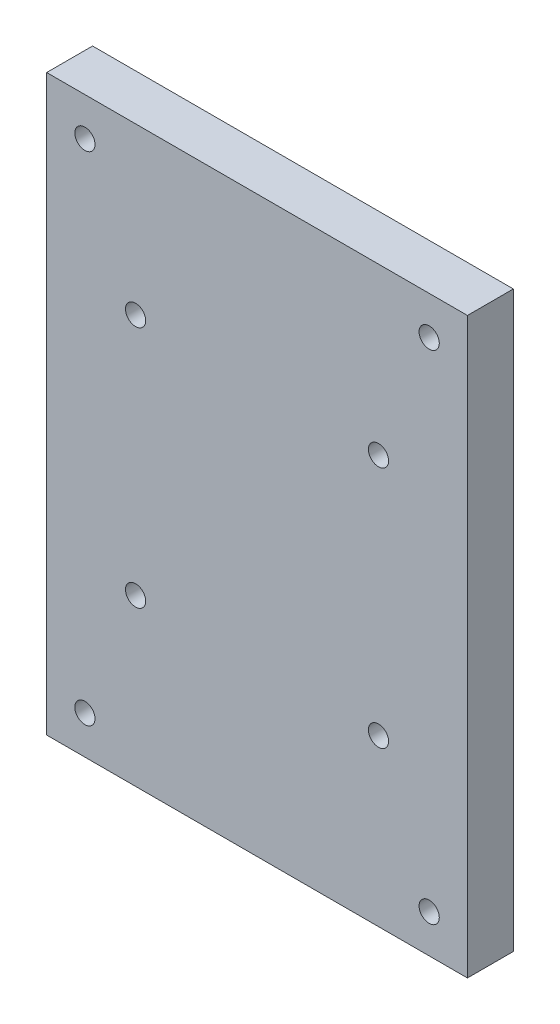
ISO-10303-21;
HEADER;
FILE_DESCRIPTION(('STEP AP214'),'2;1');
FILE_NAME('part.step','',(''),(''),'','','');
FILE_SCHEMA(('AUTOMOTIVE_DESIGN { 1 0 10303 214 1 1 1 1 }'));
ENDSEC;
DATA;
#1=APPLICATION_CONTEXT('core data for automotive mechanical design processes');
#2=APPLICATION_PROTOCOL_DEFINITION('international standard','automotive_design',2000,#1);
#3=PRODUCT_CONTEXT('',#1,'mechanical');
#4=PRODUCT('Part','Part','',(#3));
#5=PRODUCT_RELATED_PRODUCT_CATEGORY('part','',(#4));
#6=PRODUCT_DEFINITION_FORMATION('','',#4);
#7=PRODUCT_DEFINITION_CONTEXT('part definition',#1,'design');
#8=PRODUCT_DEFINITION('design','',#6,#7);
#9=PRODUCT_DEFINITION_SHAPE('','',#8);
#10=(LENGTH_UNIT() NAMED_UNIT(*) SI_UNIT(.MILLI.,.METRE.));
#11=(NAMED_UNIT(*) PLANE_ANGLE_UNIT() SI_UNIT($,.RADIAN.));
#12=(NAMED_UNIT(*) SI_UNIT($,.STERADIAN.) SOLID_ANGLE_UNIT());
#13=UNCERTAINTY_MEASURE_WITH_UNIT(LENGTH_MEASURE(1.E-05),#10,'distance_accuracy_value','');
#14=(GEOMETRIC_REPRESENTATION_CONTEXT(3) GLOBAL_UNCERTAINTY_ASSIGNED_CONTEXT((#13)) GLOBAL_UNIT_ASSIGNED_CONTEXT((#10,
#11,#12)) REPRESENTATION_CONTEXT('',''));
#15=CARTESIAN_POINT('',(0.,0.,0.));
#16=DIRECTION('',(0.,0.,1.));
#17=DIRECTION('',(1.,0.,0.));
#18=AXIS2_PLACEMENT_3D('',#15,#16,#17);
#19=CARTESIAN_POINT('',(-11.6249999999999,-53.3750000000001,6.));
#20=DIRECTION('',(0.,0.,-1.));
#21=DIRECTION('',(-1.,0.,0.));
#22=AXIS2_PLACEMENT_3D('',#19,#20,#21);
#23=CYLINDRICAL_SURFACE('',#22,1.32);
#24=CARTESIAN_POINT('',(-11.6249999999999,-53.3750000000001,6.));
#25=DIRECTION('',(0.,0.,1.));
#26=DIRECTION('',(1.,0.,0.));
#27=AXIS2_PLACEMENT_3D('',#24,#25,#26);
#28=CIRCLE('',#27,1.32);
#29=CARTESIAN_POINT('',(-10.3049999999999,-53.3750000000001,6.));
#30=VERTEX_POINT('',#29);
#31=EDGE_CURVE('E166',#30,#30,#28,.T.);
#32=ORIENTED_EDGE('',*,*,#31,.T.);
#33=EDGE_LOOP('',(#32));
#34=FACE_BOUND('',#33,.T.);
#35=CARTESIAN_POINT('',(-11.6249999999999,-53.3750000000001,4.));
#36=DIRECTION('',(0.,0.,-1.));
#37=DIRECTION('',(-1.,0.,0.));
#38=AXIS2_PLACEMENT_3D('',#35,#36,#37);
#39=CIRCLE('',#38,1.32);
#40=CARTESIAN_POINT('',(-12.9449999999999,-53.3750000000001,4.));
#41=VERTEX_POINT('',#40);
#42=EDGE_CURVE('E39',#41,#41,#39,.T.);
#43=ORIENTED_EDGE('',*,*,#42,.T.);
#44=EDGE_LOOP('',(#43));
#45=FACE_BOUND('',#44,.T.);
#46=ADVANCED_FACE('F35',(#34,#45),#23,.F.);
#47=CARTESIAN_POINT('',(-43.3750000000002,-53.3750000000001,6.));
#48=DIRECTION('',(0.,0.,-1.));
#49=DIRECTION('',(-1.,0.,0.));
#50=AXIS2_PLACEMENT_3D('',#47,#48,#49);
#51=CYLINDRICAL_SURFACE('',#50,1.32);
#52=CARTESIAN_POINT('',(-43.3750000000002,-53.3750000000001,6.));
#53=DIRECTION('',(0.,0.,1.));
#54=DIRECTION('',(1.,0.,0.));
#55=AXIS2_PLACEMENT_3D('',#52,#53,#54);
#56=CIRCLE('',#55,1.32);
#57=CARTESIAN_POINT('',(-42.0550000000002,-53.3750000000001,6.));
#58=VERTEX_POINT('',#57);
#59=EDGE_CURVE('E161',#58,#58,#56,.T.);
#60=ORIENTED_EDGE('',*,*,#59,.T.);
#61=EDGE_LOOP('',(#60));
#62=FACE_BOUND('',#61,.T.);
#63=CARTESIAN_POINT('',(-43.3750000000002,-53.3750000000001,4.));
#64=DIRECTION('',(0.,0.,-1.));
#65=DIRECTION('',(-1.,0.,0.));
#66=AXIS2_PLACEMENT_3D('',#63,#64,#65);
#67=CIRCLE('',#66,1.32);
#68=CARTESIAN_POINT('',(-44.6950000000002,-53.3750000000001,4.));
#69=VERTEX_POINT('',#68);
#70=EDGE_CURVE('E121',#69,#69,#67,.T.);
#71=ORIENTED_EDGE('',*,*,#70,.T.);
#72=EDGE_LOOP('',(#71));
#73=FACE_BOUND('',#72,.T.);
#74=ADVANCED_FACE('F201',(#62,#73),#51,.F.);
#75=CARTESIAN_POINT('',(-43.3750000000002,-21.6250000000001,6.));
#76=DIRECTION('',(0.,0.,-1.));
#77=DIRECTION('',(-1.,0.,0.));
#78=AXIS2_PLACEMENT_3D('',#75,#76,#77);
#79=CYLINDRICAL_SURFACE('',#78,1.32);
#80=CARTESIAN_POINT('',(-43.3750000000002,-21.6250000000001,6.));
#81=DIRECTION('',(0.,0.,1.));
#82=DIRECTION('',(1.,0.,0.));
#83=AXIS2_PLACEMENT_3D('',#80,#81,#82);
#84=CIRCLE('',#83,1.32);
#85=CARTESIAN_POINT('',(-42.0550000000002,-21.6250000000001,6.));
#86=VERTEX_POINT('',#85);
#87=EDGE_CURVE('E106',#86,#86,#84,.T.);
#88=ORIENTED_EDGE('',*,*,#87,.T.);
#89=EDGE_LOOP('',(#88));
#90=FACE_BOUND('',#89,.T.);
#91=CARTESIAN_POINT('',(-43.3750000000002,-21.6250000000001,4.));
#92=DIRECTION('',(0.,0.,-1.));
#93=DIRECTION('',(-1.,0.,0.));
#94=AXIS2_PLACEMENT_3D('',#91,#92,#93);
#95=CIRCLE('',#94,1.32);
#96=CARTESIAN_POINT('',(-44.6950000000002,-21.6250000000001,4.));
#97=VERTEX_POINT('',#96);
#98=EDGE_CURVE('E117',#97,#97,#95,.T.);
#99=ORIENTED_EDGE('',*,*,#98,.T.);
#100=EDGE_LOOP('',(#99));
#101=FACE_BOUND('',#100,.T.);
#102=ADVANCED_FACE('F181',(#90,#101),#79,.F.);
#103=CARTESIAN_POINT('',(-11.6250000000002,-21.6250000000001,6.));
#104=DIRECTION('',(0.,0.,-1.));
#105=DIRECTION('',(-1.,0.,0.));
#106=AXIS2_PLACEMENT_3D('',#103,#104,#105);
#107=CYLINDRICAL_SURFACE('',#106,1.32);
#108=CARTESIAN_POINT('',(-11.6250000000002,-21.6250000000001,6.));
#109=DIRECTION('',(0.,0.,1.));
#110=DIRECTION('',(1.,0.,0.));
#111=AXIS2_PLACEMENT_3D('',#108,#109,#110);
#112=CIRCLE('',#111,1.32);
#113=CARTESIAN_POINT('',(-10.3050000000002,-21.6250000000001,6.));
#114=VERTEX_POINT('',#113);
#115=EDGE_CURVE('E169',#114,#114,#112,.T.);
#116=ORIENTED_EDGE('',*,*,#115,.T.);
#117=EDGE_LOOP('',(#116));
#118=FACE_BOUND('',#117,.T.);
#119=CARTESIAN_POINT('',(-11.6250000000002,-21.6250000000001,4.));
#120=DIRECTION('',(0.,0.,-1.));
#121=DIRECTION('',(-1.,0.,0.));
#122=AXIS2_PLACEMENT_3D('',#119,#120,#121);
#123=CIRCLE('',#122,1.32);
#124=CARTESIAN_POINT('',(-12.9450000000002,-21.6250000000001,4.));
#125=VERTEX_POINT('',#124);
#126=EDGE_CURVE('E112',#125,#125,#123,.T.);
#127=ORIENTED_EDGE('',*,*,#126,.T.);
#128=EDGE_LOOP('',(#127));
#129=FACE_BOUND('',#128,.T.);
#130=ADVANCED_FACE('F186',(#118,#129),#107,.F.);
#131=CARTESIAN_POINT('',(0.,0.,6.));
#132=DIRECTION('',(0.,0.,-1.));
#133=DIRECTION('',(-1.,0.,0.));
#134=AXIS2_PLACEMENT_3D('',#131,#132,#133);
#135=PLANE('',#134);
#136=CARTESIAN_POINT('',(-4.99999999999932,-70.,6.));
#137=DIRECTION('',(0.,0.,1.));
#138=DIRECTION('',(1.,0.,0.));
#139=AXIS2_PLACEMENT_3D('',#136,#137,#138);
#140=CIRCLE('',#139,1.32);
#141=CARTESIAN_POINT('',(-3.67999999999932,-70.,6.));
#142=VERTEX_POINT('',#141);
#143=EDGE_CURVE('E152',#142,#142,#140,.T.);
#144=ORIENTED_EDGE('',*,*,#143,.F.);
#145=EDGE_LOOP('',(#144));
#146=FACE_BOUND('',#145,.T.);
#147=ORIENTED_EDGE('',*,*,#59,.F.);
#148=EDGE_LOOP('',(#147));
#149=FACE_BOUND('',#148,.T.);
#150=ORIENTED_EDGE('',*,*,#115,.F.);
#151=EDGE_LOOP('',(#150));
#152=FACE_BOUND('',#151,.T.);
#153=ORIENTED_EDGE('',*,*,#87,.F.);
#154=EDGE_LOOP('',(#153));
#155=FACE_BOUND('',#154,.T.);
#156=DIRECTION('',(0.,1.,0.));
#157=VECTOR('',#156,1.);
#158=CARTESIAN_POINT('',(0.,0.,6.));
#159=LINE('',#158,#157);
#160=CARTESIAN_POINT('',(0.,-75.,6.));
#161=VERTEX_POINT('',#160);
#162=CARTESIAN_POINT('',(0.,0.,6.));
#163=VERTEX_POINT('',#162);
#164=EDGE_CURVE('E90',#161,#163,#159,.T.);
#165=ORIENTED_EDGE('',*,*,#164,.T.);
#166=DIRECTION('',(-1.,0.,0.));
#167=VECTOR('',#166,1.);
#168=CARTESIAN_POINT('',(0.,0.,6.));
#169=LINE('',#168,#167);
#170=CARTESIAN_POINT('',(-55.,0.,6.));
#171=VERTEX_POINT('',#170);
#172=EDGE_CURVE('E84',#163,#171,#169,.T.);
#173=ORIENTED_EDGE('',*,*,#172,.T.);
#174=DIRECTION('',(0.,-1.,0.));
#175=VECTOR('',#174,1.);
#176=CARTESIAN_POINT('',(-55.,0.,6.));
#177=LINE('',#176,#175);
#178=CARTESIAN_POINT('',(-55.,-75.,6.));
#179=VERTEX_POINT('',#178);
#180=EDGE_CURVE('E88',#171,#179,#177,.T.);
#181=ORIENTED_EDGE('',*,*,#180,.T.);
#182=DIRECTION('',(1.,0.,0.));
#183=VECTOR('',#182,1.);
#184=CARTESIAN_POINT('',(0.,-75.,6.));
#185=LINE('',#184,#183);
#186=EDGE_CURVE('E54',#179,#161,#185,.T.);
#187=ORIENTED_EDGE('',*,*,#186,.T.);
#188=EDGE_LOOP('',(#165,#173,#181,#187));
#189=FACE_BOUND('',#188,.T.);
#190=CARTESIAN_POINT('',(-50.,-5.,6.));
#191=DIRECTION('',(0.,0.,1.));
#192=DIRECTION('',(1.,0.,0.));
#193=AXIS2_PLACEMENT_3D('',#190,#191,#192);
#194=CIRCLE('',#193,1.32);
#195=CARTESIAN_POINT('',(-48.68,-5.,6.));
#196=VERTEX_POINT('',#195);
#197=EDGE_CURVE('E173',#196,#196,#194,.T.);
#198=ORIENTED_EDGE('',*,*,#197,.F.);
#199=EDGE_LOOP('',(#198));
#200=FACE_BOUND('',#199,.T.);
#201=ORIENTED_EDGE('',*,*,#31,.F.);
#202=EDGE_LOOP('',(#201));
#203=FACE_BOUND('',#202,.T.);
#204=CARTESIAN_POINT('',(-5.,-5.,6.));
#205=DIRECTION('',(0.,0.,1.));
#206=DIRECTION('',(1.,0.,0.));
#207=AXIS2_PLACEMENT_3D('',#204,#205,#206);
#208=CIRCLE('',#207,1.32);
#209=CARTESIAN_POINT('',(-3.68,-5.,6.));
#210=VERTEX_POINT('',#209);
#211=EDGE_CURVE('E158',#210,#210,#208,.T.);
#212=ORIENTED_EDGE('',*,*,#211,.F.);
#213=EDGE_LOOP('',(#212));
#214=FACE_BOUND('',#213,.T.);
#215=CARTESIAN_POINT('',(-49.9999999999993,-70.,6.));
#216=DIRECTION('',(0.,0.,1.));
#217=DIRECTION('',(1.,0.,0.));
#218=AXIS2_PLACEMENT_3D('',#215,#216,#217);
#219=CIRCLE('',#218,1.32);
#220=CARTESIAN_POINT('',(-48.6799999999993,-70.,6.));
#221=VERTEX_POINT('',#220);
#222=EDGE_CURVE('E146',#221,#221,#219,.T.);
#223=ORIENTED_EDGE('',*,*,#222,.F.);
#224=EDGE_LOOP('',(#223));
#225=FACE_BOUND('',#224,.T.);
#226=ADVANCED_FACE('F85',(#146,#149,#152,#155,#189,#200,#203,#214,#225),#135,.F.);
#227=CARTESIAN_POINT('',(0.,0.,0.));
#228=DIRECTION('',(0.,0.,-1.));
#229=DIRECTION('',(-1.,0.,0.));
#230=AXIS2_PLACEMENT_3D('',#227,#228,#229);
#231=PLANE('',#230);
#232=CARTESIAN_POINT('',(-11.6250000000006,-53.3750000000001,0.));
#233=DIRECTION('',(0.,0.,-1.));
#234=DIRECTION('',(-1.,0.,0.));
#235=AXIS2_PLACEMENT_3D('',#232,#233,#234);
#236=CIRCLE('',#235,3.25);
#237=CARTESIAN_POINT('',(-14.8750000000006,-53.3750000000001,0.));
#238=VERTEX_POINT('',#237);
#239=EDGE_CURVE('E137',#238,#238,#236,.T.);
#240=ORIENTED_EDGE('',*,*,#239,.F.);
#241=EDGE_LOOP('',(#240));
#242=FACE_BOUND('',#241,.T.);
#243=CARTESIAN_POINT('',(-43.3750000000006,-53.3750000000001,0.));
#244=DIRECTION('',(0.,0.,-1.));
#245=DIRECTION('',(-1.,0.,0.));
#246=AXIS2_PLACEMENT_3D('',#243,#244,#245);
#247=CIRCLE('',#246,3.25000000000001);
#248=CARTESIAN_POINT('',(-46.6250000000006,-53.3750000000001,0.));
#249=VERTEX_POINT('',#248);
#250=EDGE_CURVE('E130',#249,#249,#247,.T.);
#251=ORIENTED_EDGE('',*,*,#250,.F.);
#252=EDGE_LOOP('',(#251));
#253=FACE_BOUND('',#252,.T.);
#254=CARTESIAN_POINT('',(-43.3750000000002,-21.6250000000001,0.));
#255=DIRECTION('',(0.,0.,-1.));
#256=DIRECTION('',(-1.,0.,0.));
#257=AXIS2_PLACEMENT_3D('',#254,#255,#256);
#258=CIRCLE('',#257,3.25000000000001);
#259=CARTESIAN_POINT('',(-46.6250000000002,-21.6250000000001,0.));
#260=VERTEX_POINT('',#259);
#261=EDGE_CURVE('E123',#260,#260,#258,.T.);
#262=ORIENTED_EDGE('',*,*,#261,.F.);
#263=EDGE_LOOP('',(#262));
#264=FACE_BOUND('',#263,.T.);
#265=CARTESIAN_POINT('',(-11.6250000000002,-21.6250000000001,0.));
#266=DIRECTION('',(0.,0.,-1.));
#267=DIRECTION('',(-1.,0.,0.));
#268=AXIS2_PLACEMENT_3D('',#265,#266,#267);
#269=CIRCLE('',#268,3.25);
#270=CARTESIAN_POINT('',(-14.8750000000002,-21.6250000000001,0.));
#271=VERTEX_POINT('',#270);
#272=EDGE_CURVE('E119',#271,#271,#269,.T.);
#273=ORIENTED_EDGE('',*,*,#272,.F.);
#274=EDGE_LOOP('',(#273));
#275=FACE_BOUND('',#274,.T.);
#276=CARTESIAN_POINT('',(-4.99999999999932,-70.,0.));
#277=DIRECTION('',(0.,0.,1.));
#278=DIRECTION('',(1.,0.,0.));
#279=AXIS2_PLACEMENT_3D('',#276,#277,#278);
#280=CIRCLE('',#279,1.32);
#281=CARTESIAN_POINT('',(-3.67999999999932,-70.,0.));
#282=VERTEX_POINT('',#281);
#283=EDGE_CURVE('E149',#282,#282,#280,.T.);
#284=ORIENTED_EDGE('',*,*,#283,.T.);
#285=EDGE_LOOP('',(#284));
#286=FACE_BOUND('',#285,.T.);
#287=DIRECTION('',(0.,1.,0.));
#288=VECTOR('',#287,1.);
#289=CARTESIAN_POINT('',(0.,0.,0.));
#290=LINE('',#289,#288);
#291=CARTESIAN_POINT('',(0.,-75.,0.));
#292=VERTEX_POINT('',#291);
#293=CARTESIAN_POINT('',(0.,0.,0.));
#294=VERTEX_POINT('',#293);
#295=EDGE_CURVE('E103',#292,#294,#290,.T.);
#296=ORIENTED_EDGE('',*,*,#295,.F.);
#297=DIRECTION('',(1.,0.,0.));
#298=VECTOR('',#297,1.);
#299=CARTESIAN_POINT('',(0.,-75.,0.));
#300=LINE('',#299,#298);
#301=CARTESIAN_POINT('',(-55.,-75.,0.));
#302=VERTEX_POINT('',#301);
#303=EDGE_CURVE('E77',#302,#292,#300,.T.);
#304=ORIENTED_EDGE('',*,*,#303,.F.);
#305=DIRECTION('',(0.,-1.,0.));
#306=VECTOR('',#305,1.);
#307=CARTESIAN_POINT('',(-55.,0.,0.));
#308=LINE('',#307,#306);
#309=CARTESIAN_POINT('',(-55.,0.,0.));
#310=VERTEX_POINT('',#309);
#311=EDGE_CURVE('E71',#310,#302,#308,.T.);
#312=ORIENTED_EDGE('',*,*,#311,.F.);
#313=DIRECTION('',(-1.,0.,0.));
#314=VECTOR('',#313,1.);
#315=CARTESIAN_POINT('',(0.,0.,0.));
#316=LINE('',#315,#314);
#317=EDGE_CURVE('E94',#294,#310,#316,.T.);
#318=ORIENTED_EDGE('',*,*,#317,.F.);
#319=EDGE_LOOP('',(#296,#304,#312,#318));
#320=FACE_BOUND('',#319,.T.);
#321=CARTESIAN_POINT('',(-50.,-5.,0.));
#322=DIRECTION('',(0.,0.,1.));
#323=DIRECTION('',(1.,0.,0.));
#324=AXIS2_PLACEMENT_3D('',#321,#322,#323);
#325=CIRCLE('',#324,1.32);
#326=CARTESIAN_POINT('',(-48.68,-5.,0.));
#327=VERTEX_POINT('',#326);
#328=EDGE_CURVE('E172',#327,#327,#325,.T.);
#329=ORIENTED_EDGE('',*,*,#328,.T.);
#330=EDGE_LOOP('',(#329));
#331=FACE_BOUND('',#330,.T.);
#332=CARTESIAN_POINT('',(-5.,-5.,0.));
#333=DIRECTION('',(0.,0.,1.));
#334=DIRECTION('',(1.,0.,0.));
#335=AXIS2_PLACEMENT_3D('',#332,#333,#334);
#336=CIRCLE('',#335,1.32);
#337=CARTESIAN_POINT('',(-3.68,-5.,0.));
#338=VERTEX_POINT('',#337);
#339=EDGE_CURVE('E155',#338,#338,#336,.T.);
#340=ORIENTED_EDGE('',*,*,#339,.T.);
#341=EDGE_LOOP('',(#340));
#342=FACE_BOUND('',#341,.T.);
#343=CARTESIAN_POINT('',(-49.9999999999993,-70.,0.));
#344=DIRECTION('',(0.,0.,1.));
#345=DIRECTION('',(1.,0.,0.));
#346=AXIS2_PLACEMENT_3D('',#343,#344,#345);
#347=CIRCLE('',#346,1.32);
#348=CARTESIAN_POINT('',(-48.6799999999993,-70.,0.));
#349=VERTEX_POINT('',#348);
#350=EDGE_CURVE('E115',#349,#349,#347,.T.);
#351=ORIENTED_EDGE('',*,*,#350,.T.);
#352=EDGE_LOOP('',(#351));
#353=FACE_BOUND('',#352,.T.);
#354=ADVANCED_FACE('F185',(#242,#253,#264,#275,#286,#320,#331,#342,#353),#231,.T.);
#355=CARTESIAN_POINT('',(0.,0.,6.));
#356=DIRECTION('',(-1.,0.,0.));
#357=DIRECTION('',(0.,-1.,0.));
#358=AXIS2_PLACEMENT_3D('',#355,#356,#357);
#359=PLANE('',#358);
#360=ORIENTED_EDGE('',*,*,#295,.T.);
#361=DIRECTION('',(0.,0.,-1.));
#362=VECTOR('',#361,1.);
#363=CARTESIAN_POINT('',(0.,0.,6.));
#364=LINE('',#363,#362);
#365=EDGE_CURVE('E11',#163,#294,#364,.T.);
#366=ORIENTED_EDGE('',*,*,#365,.F.);
#367=ORIENTED_EDGE('',*,*,#164,.F.);
#368=DIRECTION('',(0.,0.,-1.));
#369=VECTOR('',#368,1.);
#370=CARTESIAN_POINT('',(0.,-75.,6.));
#371=LINE('',#370,#369);
#372=EDGE_CURVE('E99',#161,#292,#371,.T.);
#373=ORIENTED_EDGE('',*,*,#372,.T.);
#374=EDGE_LOOP('',(#360,#366,#367,#373));
#375=FACE_BOUND('',#374,.T.);
#376=ADVANCED_FACE('F37',(#375),#359,.F.);
#377=CARTESIAN_POINT('',(0.,0.,6.));
#378=DIRECTION('',(0.,-1.,0.));
#379=DIRECTION('',(1.,0.,0.));
#380=AXIS2_PLACEMENT_3D('',#377,#378,#379);
#381=PLANE('',#380);
#382=ORIENTED_EDGE('',*,*,#317,.T.);
#383=DIRECTION('',(0.,0.,-1.));
#384=VECTOR('',#383,1.);
#385=CARTESIAN_POINT('',(-55.,0.,6.));
#386=LINE('',#385,#384);
#387=EDGE_CURVE('E45',#171,#310,#386,.T.);
#388=ORIENTED_EDGE('',*,*,#387,.F.);
#389=ORIENTED_EDGE('',*,*,#172,.F.);
#390=ORIENTED_EDGE('',*,*,#365,.T.);
#391=EDGE_LOOP('',(#382,#388,#389,#390));
#392=FACE_BOUND('',#391,.T.);
#393=ADVANCED_FACE('F93',(#392),#381,.F.);
#394=CARTESIAN_POINT('',(-55.,0.,6.));
#395=DIRECTION('',(1.,0.,0.));
#396=DIRECTION('',(0.,1.,0.));
#397=AXIS2_PLACEMENT_3D('',#394,#395,#396);
#398=PLANE('',#397);
#399=ORIENTED_EDGE('',*,*,#311,.T.);
#400=DIRECTION('',(0.,0.,-1.));
#401=VECTOR('',#400,1.);
#402=CARTESIAN_POINT('',(-55.,-75.,6.));
#403=LINE('',#402,#401);
#404=EDGE_CURVE('E95',#179,#302,#403,.T.);
#405=ORIENTED_EDGE('',*,*,#404,.F.);
#406=ORIENTED_EDGE('',*,*,#180,.F.);
#407=ORIENTED_EDGE('',*,*,#387,.T.);
#408=EDGE_LOOP('',(#399,#405,#406,#407));
#409=FACE_BOUND('',#408,.T.);
#410=ADVANCED_FACE('F97',(#409),#398,.F.);
#411=CARTESIAN_POINT('',(0.,-75.,6.));
#412=DIRECTION('',(0.,1.,0.));
#413=DIRECTION('',(-1.,0.,0.));
#414=AXIS2_PLACEMENT_3D('',#411,#412,#413);
#415=PLANE('',#414);
#416=ORIENTED_EDGE('',*,*,#303,.T.);
#417=ORIENTED_EDGE('',*,*,#372,.F.);
#418=ORIENTED_EDGE('',*,*,#186,.F.);
#419=ORIENTED_EDGE('',*,*,#404,.T.);
#420=EDGE_LOOP('',(#416,#417,#418,#419));
#421=FACE_BOUND('',#420,.T.);
#422=ADVANCED_FACE('F215',(#421),#415,.F.);
#423=CARTESIAN_POINT('',(-50.,-5.,6.));
#424=DIRECTION('',(0.,0.,-1.));
#425=DIRECTION('',(-1.,0.,0.));
#426=AXIS2_PLACEMENT_3D('',#423,#424,#425);
#427=CYLINDRICAL_SURFACE('',#426,1.32);
#428=ORIENTED_EDGE('',*,*,#197,.T.);
#429=EDGE_LOOP('',(#428));
#430=FACE_BOUND('',#429,.T.);
#431=ORIENTED_EDGE('',*,*,#328,.F.);
#432=EDGE_LOOP('',(#431));
#433=FACE_BOUND('',#432,.T.);
#434=ADVANCED_FACE('F212',(#430,#433),#427,.F.);
#435=CARTESIAN_POINT('',(-5.,-5.,6.));
#436=DIRECTION('',(0.,0.,-1.));
#437=DIRECTION('',(-1.,0.,0.));
#438=AXIS2_PLACEMENT_3D('',#435,#436,#437);
#439=CYLINDRICAL_SURFACE('',#438,1.32);
#440=ORIENTED_EDGE('',*,*,#211,.T.);
#441=EDGE_LOOP('',(#440));
#442=FACE_BOUND('',#441,.T.);
#443=ORIENTED_EDGE('',*,*,#339,.F.);
#444=EDGE_LOOP('',(#443));
#445=FACE_BOUND('',#444,.T.);
#446=ADVANCED_FACE('F214',(#442,#445),#439,.F.);
#447=CARTESIAN_POINT('',(-4.99999999999932,-70.,6.));
#448=DIRECTION('',(0.,0.,-1.));
#449=DIRECTION('',(-1.,0.,0.));
#450=AXIS2_PLACEMENT_3D('',#447,#448,#449);
#451=CYLINDRICAL_SURFACE('',#450,1.32);
#452=ORIENTED_EDGE('',*,*,#143,.T.);
#453=EDGE_LOOP('',(#452));
#454=FACE_BOUND('',#453,.T.);
#455=ORIENTED_EDGE('',*,*,#283,.F.);
#456=EDGE_LOOP('',(#455));
#457=FACE_BOUND('',#456,.T.);
#458=ADVANCED_FACE('F327',(#454,#457),#451,.F.);
#459=CARTESIAN_POINT('',(-49.9999999999993,-70.,6.));
#460=DIRECTION('',(0.,0.,-1.));
#461=DIRECTION('',(-1.,0.,0.));
#462=AXIS2_PLACEMENT_3D('',#459,#460,#461);
#463=CYLINDRICAL_SURFACE('',#462,1.32);
#464=ORIENTED_EDGE('',*,*,#222,.T.);
#465=EDGE_LOOP('',(#464));
#466=FACE_BOUND('',#465,.T.);
#467=ORIENTED_EDGE('',*,*,#350,.F.);
#468=EDGE_LOOP('',(#467));
#469=FACE_BOUND('',#468,.T.);
#470=ADVANCED_FACE('F247',(#466,#469),#463,.F.);
#471=CARTESIAN_POINT('',(-11.6250000000002,-21.6250000000001,4.));
#472=DIRECTION('',(0.,0.,-1.));
#473=DIRECTION('',(-1.,0.,0.));
#474=AXIS2_PLACEMENT_3D('',#471,#472,#473);
#475=CYLINDRICAL_SURFACE('',#474,3.25);
#476=CARTESIAN_POINT('',(-11.6250000000002,-21.6250000000001,4.));
#477=DIRECTION('',(0.,0.,-1.));
#478=DIRECTION('',(-1.,0.,0.));
#479=AXIS2_PLACEMENT_3D('',#476,#477,#478);
#480=CIRCLE('',#479,3.25);
#481=CARTESIAN_POINT('',(-14.8750000000002,-21.6250000000001,4.));
#482=VERTEX_POINT('',#481);
#483=EDGE_CURVE('E116',#482,#482,#480,.T.);
#484=ORIENTED_EDGE('',*,*,#483,.F.);
#485=EDGE_LOOP('',(#484));
#486=FACE_BOUND('',#485,.T.);
#487=ORIENTED_EDGE('',*,*,#272,.T.);
#488=EDGE_LOOP('',(#487));
#489=FACE_BOUND('',#488,.T.);
#490=ADVANCED_FACE('F241',(#486,#489),#475,.F.);
#491=CARTESIAN_POINT('',(-11.6250000000002,-21.6250000000001,4.));
#492=DIRECTION('',(0.,0.,-1.));
#493=DIRECTION('',(-1.,0.,0.));
#494=AXIS2_PLACEMENT_3D('',#491,#492,#493);
#495=PLANE('',#494);
#496=ORIENTED_EDGE('',*,*,#126,.F.);
#497=EDGE_LOOP('',(#496));
#498=FACE_BOUND('',#497,.T.);
#499=ORIENTED_EDGE('',*,*,#483,.T.);
#500=EDGE_LOOP('',(#499));
#501=FACE_BOUND('',#500,.T.);
#502=ADVANCED_FACE('F246',(#498,#501),#495,.T.);
#503=CARTESIAN_POINT('',(-43.3750000000002,-21.6250000000001,4.));
#504=DIRECTION('',(0.,0.,-1.));
#505=DIRECTION('',(-1.,0.,0.));
#506=AXIS2_PLACEMENT_3D('',#503,#504,#505);
#507=CYLINDRICAL_SURFACE('',#506,3.25000000000001);
#508=CARTESIAN_POINT('',(-43.3750000000002,-21.6250000000001,4.));
#509=DIRECTION('',(0.,0.,-1.));
#510=DIRECTION('',(-1.,0.,0.));
#511=AXIS2_PLACEMENT_3D('',#508,#509,#510);
#512=CIRCLE('',#511,3.25000000000001);
#513=CARTESIAN_POINT('',(-46.6250000000002,-21.6250000000001,4.));
#514=VERTEX_POINT('',#513);
#515=EDGE_CURVE('E120',#514,#514,#512,.T.);
#516=ORIENTED_EDGE('',*,*,#515,.F.);
#517=EDGE_LOOP('',(#516));
#518=FACE_BOUND('',#517,.T.);
#519=ORIENTED_EDGE('',*,*,#261,.T.);
#520=EDGE_LOOP('',(#519));
#521=FACE_BOUND('',#520,.T.);
#522=ADVANCED_FACE('F259',(#518,#521),#507,.F.);
#523=CARTESIAN_POINT('',(-43.3750000000002,-21.6250000000001,4.));
#524=DIRECTION('',(0.,0.,-1.));
#525=DIRECTION('',(-1.,0.,0.));
#526=AXIS2_PLACEMENT_3D('',#523,#524,#525);
#527=PLANE('',#526);
#528=ORIENTED_EDGE('',*,*,#98,.F.);
#529=EDGE_LOOP('',(#528));
#530=FACE_BOUND('',#529,.T.);
#531=ORIENTED_EDGE('',*,*,#515,.T.);
#532=EDGE_LOOP('',(#531));
#533=FACE_BOUND('',#532,.T.);
#534=ADVANCED_FACE('F269',(#530,#533),#527,.T.);
#535=CARTESIAN_POINT('',(-43.3750000000006,-53.3750000000001,4.));
#536=DIRECTION('',(0.,0.,-1.));
#537=DIRECTION('',(-1.,0.,0.));
#538=AXIS2_PLACEMENT_3D('',#535,#536,#537);
#539=CYLINDRICAL_SURFACE('',#538,3.25000000000001);
#540=CARTESIAN_POINT('',(-43.3750000000006,-53.3750000000001,4.));
#541=DIRECTION('',(0.,0.,-1.));
#542=DIRECTION('',(-1.,0.,0.));
#543=AXIS2_PLACEMENT_3D('',#540,#541,#542);
#544=CIRCLE('',#543,3.25000000000001);
#545=CARTESIAN_POINT('',(-46.6250000000006,-53.3750000000001,4.));
#546=VERTEX_POINT('',#545);
#547=EDGE_CURVE('E124',#546,#546,#544,.T.);
#548=ORIENTED_EDGE('',*,*,#547,.F.);
#549=EDGE_LOOP('',(#548));
#550=FACE_BOUND('',#549,.T.);
#551=ORIENTED_EDGE('',*,*,#250,.T.);
#552=EDGE_LOOP('',(#551));
#553=FACE_BOUND('',#552,.T.);
#554=ADVANCED_FACE('F279',(#550,#553),#539,.F.);
#555=CARTESIAN_POINT('',(-43.3750000000006,-53.3750000000001,4.));
#556=DIRECTION('',(0.,0.,-1.));
#557=DIRECTION('',(-1.,0.,0.));
#558=AXIS2_PLACEMENT_3D('',#555,#556,#557);
#559=PLANE('',#558);
#560=ORIENTED_EDGE('',*,*,#70,.F.);
#561=EDGE_LOOP('',(#560));
#562=FACE_BOUND('',#561,.T.);
#563=ORIENTED_EDGE('',*,*,#547,.T.);
#564=EDGE_LOOP('',(#563));
#565=FACE_BOUND('',#564,.T.);
#566=ADVANCED_FACE('F289',(#562,#565),#559,.T.);
#567=CARTESIAN_POINT('',(-11.6250000000006,-53.3750000000001,4.));
#568=DIRECTION('',(0.,0.,-1.));
#569=DIRECTION('',(-1.,0.,0.));
#570=AXIS2_PLACEMENT_3D('',#567,#568,#569);
#571=CYLINDRICAL_SURFACE('',#570,3.25);
#572=CARTESIAN_POINT('',(-11.6250000000006,-53.3750000000001,4.));
#573=DIRECTION('',(0.,0.,-1.));
#574=DIRECTION('',(-1.,0.,0.));
#575=AXIS2_PLACEMENT_3D('',#572,#573,#574);
#576=CIRCLE('',#575,3.25);
#577=CARTESIAN_POINT('',(-14.8750000000006,-53.3750000000001,4.));
#578=VERTEX_POINT('',#577);
#579=EDGE_CURVE('E420',#578,#578,#576,.T.);
#580=ORIENTED_EDGE('',*,*,#579,.F.);
#581=EDGE_LOOP('',(#580));
#582=FACE_BOUND('',#581,.T.);
#583=ORIENTED_EDGE('',*,*,#239,.T.);
#584=EDGE_LOOP('',(#583));
#585=FACE_BOUND('',#584,.T.);
#586=ADVANCED_FACE('F299',(#582,#585),#571,.F.);
#587=CARTESIAN_POINT('',(-11.6250000000006,-53.3750000000001,4.));
#588=DIRECTION('',(0.,0.,-1.));
#589=DIRECTION('',(-1.,0.,0.));
#590=AXIS2_PLACEMENT_3D('',#587,#588,#589);
#591=PLANE('',#590);
#592=ORIENTED_EDGE('',*,*,#42,.F.);
#593=EDGE_LOOP('',(#592));
#594=FACE_BOUND('',#593,.T.);
#595=ORIENTED_EDGE('',*,*,#579,.T.);
#596=EDGE_LOOP('',(#595));
#597=FACE_BOUND('',#596,.T.);
#598=ADVANCED_FACE('F309',(#594,#597),#591,.T.);
#599=CLOSED_SHELL('',(#46,#74,#102,#130,#226,#354,#376,#393,#410,#422,#434,#446,#458,#470,#490,
#502,#522,#534,#554,#566,#586,#598));
#600=MANIFOLD_SOLID_BREP('B2',#599);
#601=ADVANCED_BREP_SHAPE_REPRESENTATION('',(#18,#600),#14);
#602=SHAPE_DEFINITION_REPRESENTATION(#9,#601);
ENDSEC;
END-ISO-10303-21;
